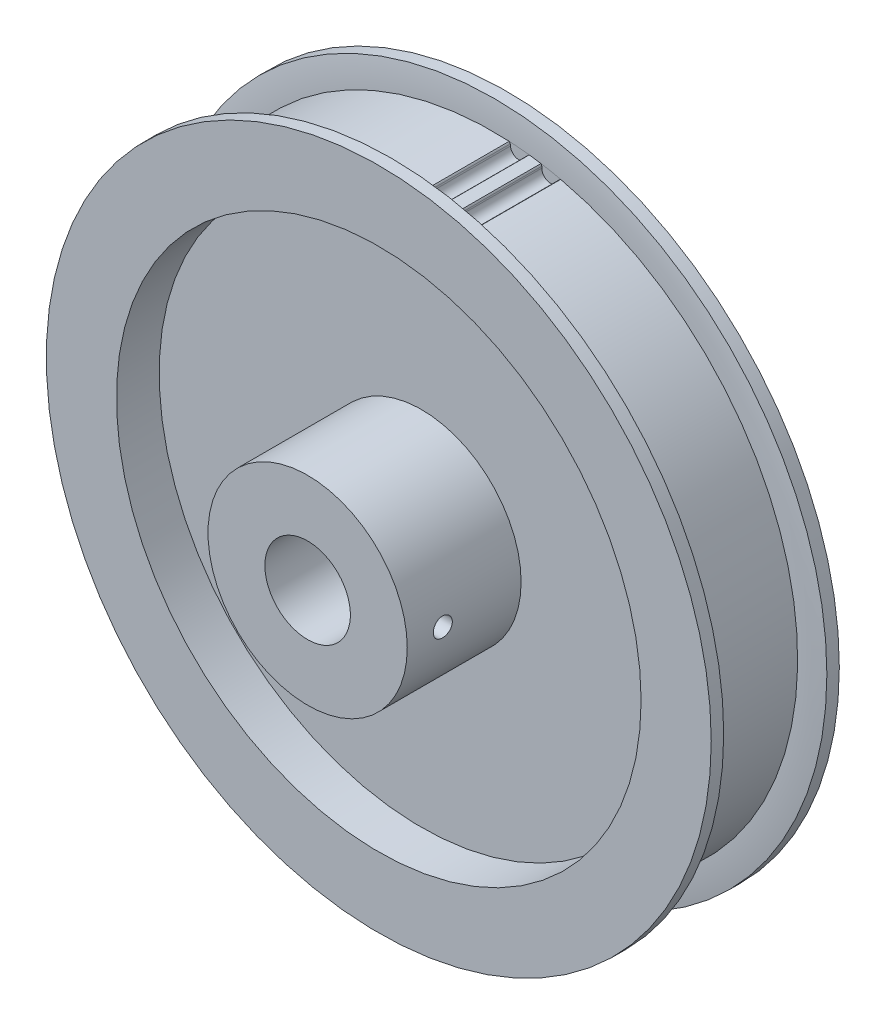
ISO-10303-21;
HEADER;
FILE_DESCRIPTION(('STEP AP214'),'2;1');
FILE_NAME('part.step','',(''),(''),'','','');
FILE_SCHEMA(('AUTOMOTIVE_DESIGN { 1 0 10303 214 1 1 1 1 }'));
ENDSEC;
DATA;
#1=APPLICATION_CONTEXT('core data for automotive mechanical design processes');
#2=APPLICATION_PROTOCOL_DEFINITION('international standard','automotive_design',2000,#1);
#3=PRODUCT_CONTEXT('',#1,'mechanical');
#4=PRODUCT('Part','Part','',(#3));
#5=PRODUCT_RELATED_PRODUCT_CATEGORY('part','',(#4));
#6=PRODUCT_DEFINITION_FORMATION('','',#4);
#7=PRODUCT_DEFINITION_CONTEXT('part definition',#1,'design');
#8=PRODUCT_DEFINITION('design','',#6,#7);
#9=PRODUCT_DEFINITION_SHAPE('','',#8);
#10=(LENGTH_UNIT() NAMED_UNIT(*) SI_UNIT(.MILLI.,.METRE.));
#11=(NAMED_UNIT(*) PLANE_ANGLE_UNIT() SI_UNIT($,.RADIAN.));
#12=(NAMED_UNIT(*) SI_UNIT($,.STERADIAN.) SOLID_ANGLE_UNIT());
#13=UNCERTAINTY_MEASURE_WITH_UNIT(LENGTH_MEASURE(1.E-05),#10,'distance_accuracy_value','');
#14=(GEOMETRIC_REPRESENTATION_CONTEXT(3) GLOBAL_UNCERTAINTY_ASSIGNED_CONTEXT((#13)) GLOBAL_UNIT_ASSIGNED_CONTEXT((#10,
#11,#12)) REPRESENTATION_CONTEXT('',''));
#15=CARTESIAN_POINT('',(0.,0.,0.));
#16=DIRECTION('',(0.,0.,1.));
#17=DIRECTION('',(1.,0.,0.));
#18=AXIS2_PLACEMENT_3D('',#15,#16,#17);
#19=CARTESIAN_POINT('',(0.,0.,15.08125));
#20=DIRECTION('',(0.,0.,-1.));
#21=DIRECTION('',(-1.,0.,0.));
#22=AXIS2_PLACEMENT_3D('',#19,#20,#21);
#23=CYLINDRICAL_SURFACE('',#22,4.76885);
#24=CARTESIAN_POINT('',(0.,0.,15.08125));
#25=DIRECTION('',(0.,0.,-1.));
#26=DIRECTION('',(-1.,0.,0.));
#27=AXIS2_PLACEMENT_3D('',#24,#25,#26);
#28=CIRCLE('',#27,4.76885);
#29=CARTESIAN_POINT('',(-4.76885,0.,15.08125));
#30=VERTEX_POINT('',#29);
#31=EDGE_CURVE('E20',#30,#30,#28,.T.);
#32=ORIENTED_EDGE('',*,*,#31,.F.);
#33=EDGE_LOOP('',(#32));
#34=FACE_BOUND('',#33,.T.);
#35=CARTESIAN_POINT('',(0.,0.,-7.14375));
#36=DIRECTION('',(0.,0.,-1.));
#37=DIRECTION('',(-1.,0.,0.));
#38=AXIS2_PLACEMENT_3D('',#35,#36,#37);
#39=CIRCLE('',#38,4.76885);
#40=CARTESIAN_POINT('',(-4.76885,0.,-7.14375));
#41=VERTEX_POINT('',#40);
#42=EDGE_CURVE('E616',#41,#41,#39,.T.);
#43=ORIENTED_EDGE('',*,*,#42,.T.);
#44=EDGE_LOOP('',(#43));
#45=FACE_BOUND('',#44,.T.);
#46=CARTESIAN_POINT('',(4.76885,0.,12.1708333333334));
#47=CARTESIAN_POINT('',(4.76884847306571,-0.0586123041048064,12.17083044195));
#48=CARTESIAN_POINT('',(4.76775734312836,-0.117295795218659,12.1659430419181));
#49=CARTESIAN_POINT('',(4.76350613938723,-0.2330437076321,12.1465291246467));
#50=CARTESIAN_POINT('',(4.7603420522376,-0.290104763764251,12.1319839086684));
#51=CARTESIAN_POINT('',(4.75229742473407,-0.400844929684411,12.0937325411842));
#52=CARTESIAN_POINT('',(4.74741952972268,-0.454529102128736,12.0700405026863));
#53=CARTESIAN_POINT('',(4.73647435346353,-0.5571418424057,12.0142065699433));
#54=CARTESIAN_POINT('',(4.7304074297014,-0.606071833002247,11.9820672144251));
#55=CARTESIAN_POINT('',(4.71763463518445,-0.698620847249218,11.9096827759978));
#56=CARTESIAN_POINT('',(4.7109205925116,-0.742149896327489,11.8693240760116));
#57=CARTESIAN_POINT('',(4.69766728828876,-0.82188187530551,11.781888529202));
#58=CARTESIAN_POINT('',(4.6911280522598,-0.858083740483086,11.734810707707));
#59=CARTESIAN_POINT('',(4.67888518332514,-0.922526682545571,11.6346126124925));
#60=CARTESIAN_POINT('',(4.67319191418832,-0.950672408242291,11.5814296333453));
#61=CARTESIAN_POINT('',(4.66340206452208,-0.997591991340194,11.4709418717254));
#62=CARTESIAN_POINT('',(4.65930527391939,-1.0163670818716,11.4136376327267));
#63=CARTESIAN_POINT('',(4.65325483593039,-1.04371677040196,11.2975035268964));
#64=CARTESIAN_POINT('',(4.65126796129376,-1.05244970180919,11.238712716185));
#65=CARTESIAN_POINT('',(4.64956255865491,-1.05995957296108,11.1204693760151));
#66=CARTESIAN_POINT('',(4.64984374652198,-1.05873775978254,11.0610169303745));
#67=CARTESIAN_POINT('',(4.65261263193993,-1.04650016245331,10.9443190716094));
#68=CARTESIAN_POINT('',(4.65505876969299,-1.03566883929887,10.8870531788706));
#69=CARTESIAN_POINT('',(4.66181620645629,-1.00481198001847,10.7751717294144));
#70=CARTESIAN_POINT('',(4.6661276262592,-0.984785848446423,10.7205563445944));
#71=CARTESIAN_POINT('',(4.67617067171151,-0.935938960169094,10.6150088795935));
#72=CARTESIAN_POINT('',(4.681913658347,-0.907047401484529,10.5641106924875));
#73=CARTESIAN_POINT('',(4.69416531023992,-0.841341705001432,10.4678204452049));
#74=CARTESIAN_POINT('',(4.70067402857244,-0.804527017880904,10.4224287671439));
#75=CARTESIAN_POINT('',(4.71390095516389,-0.723052709932271,10.3373819616924));
#76=CARTESIAN_POINT('',(4.72062061373945,-0.678237657979727,10.2978758300807));
#77=CARTESIAN_POINT('',(4.73338440331373,-0.582520218827615,10.2268984926627));
#78=CARTESIAN_POINT('',(4.73942824011096,-0.531615200324313,10.1954307785756));
#79=CARTESIAN_POINT('',(4.75018068491062,-0.424963998075343,10.1413864817509));
#80=CARTESIAN_POINT('',(4.75488521292261,-0.369203683150195,10.1188369874257));
#81=CARTESIAN_POINT('',(4.76239148758987,-0.254627675271092,10.0835132015441));
#82=CARTESIAN_POINT('',(4.76519721448175,-0.195818653498635,10.0707184550667));
#83=CARTESIAN_POINT('',(4.76754649622475,-0.113788746429426,10.0600534469669));
#84=CARTESIAN_POINT('',(4.76803417109396,-0.0910930120307624,10.0578478943051));
#85=CARTESIAN_POINT('',(4.7686862203424,-0.0456017778238444,10.0549039403021));
#86=CARTESIAN_POINT('',(4.76885059413613,-0.0228062778349896,10.0541655416179));
#87=CARTESIAN_POINT('',(4.76884847306572,0.0586123041048063,10.05416955805));
#88=CARTESIAN_POINT('',(4.76775734312836,0.117295795218659,10.0590569580819));
#89=CARTESIAN_POINT('',(4.76350613938723,0.233043707632099,10.0784708753533));
#90=CARTESIAN_POINT('',(4.7603420522376,0.290104763764251,10.0930160913316));
#91=CARTESIAN_POINT('',(4.75229742473407,0.400844929684412,10.1312674588158));
#92=CARTESIAN_POINT('',(4.74741952972267,0.454529102128737,10.1549594973137));
#93=CARTESIAN_POINT('',(4.73647435346353,0.557141842405701,10.2107934300567));
#94=CARTESIAN_POINT('',(4.7304074297014,0.606071833002247,10.2429327855749));
#95=CARTESIAN_POINT('',(4.71763463518445,0.698620847249218,10.3153172240022));
#96=CARTESIAN_POINT('',(4.7109205925116,0.742149896327489,10.3556759239884));
#97=CARTESIAN_POINT('',(4.69766728828876,0.82188187530551,10.443111470798));
#98=CARTESIAN_POINT('',(4.6911280522598,0.858083740483086,10.490189292293));
#99=CARTESIAN_POINT('',(4.67888518332514,0.922526682545571,10.5903873875075));
#100=CARTESIAN_POINT('',(4.67319191418832,0.95067240824229,10.6435703666547));
#101=CARTESIAN_POINT('',(4.66340206452208,0.997591991340194,10.7540581282746));
#102=CARTESIAN_POINT('',(4.65930527391939,1.0163670818716,10.8113623672733));
#103=CARTESIAN_POINT('',(4.65325483593039,1.04371677040196,10.9274964731036));
#104=CARTESIAN_POINT('',(4.65126796129376,1.05244970180919,10.986287283815));
#105=CARTESIAN_POINT('',(4.64956255865491,1.05995957296108,11.1045306239849));
#106=CARTESIAN_POINT('',(4.64984374652198,1.05873775978254,11.1639830696255));
#107=CARTESIAN_POINT('',(4.65261263193993,1.04650016245331,11.2806809283906));
#108=CARTESIAN_POINT('',(4.65505876969299,1.03566883929887,11.3379468211294));
#109=CARTESIAN_POINT('',(4.66181620645629,1.00481198001847,11.4498282705856));
#110=CARTESIAN_POINT('',(4.6661276262592,0.984785848446423,11.5044436554056));
#111=CARTESIAN_POINT('',(4.67617067171151,0.935938960169094,11.6099911204065));
#112=CARTESIAN_POINT('',(4.681913658347,0.907047401484529,11.6608893075125));
#113=CARTESIAN_POINT('',(4.69416531023991,0.841341705001432,11.7571795547951));
#114=CARTESIAN_POINT('',(4.70067402857244,0.804527017880904,11.8025712328561));
#115=CARTESIAN_POINT('',(4.71390095516389,0.723052709932272,11.8876180383076));
#116=CARTESIAN_POINT('',(4.72062061373945,0.678237657979727,11.9271241699193));
#117=CARTESIAN_POINT('',(4.73338440331373,0.582520218827616,11.9981015073373));
#118=CARTESIAN_POINT('',(4.73942824011096,0.531615200324313,12.0295692214244));
#119=CARTESIAN_POINT('',(4.75018068491062,0.424963998075343,12.0836135182491));
#120=CARTESIAN_POINT('',(4.75488521292261,0.369203683150194,12.1061630125743));
#121=CARTESIAN_POINT('',(4.76239148758987,0.254627675271092,12.1414867984559));
#122=CARTESIAN_POINT('',(4.76519721448175,0.195818653498635,12.1542815449333));
#123=CARTESIAN_POINT('',(4.76754649622475,0.113788746429426,12.1649465530331));
#124=CARTESIAN_POINT('',(4.76803417109396,0.0910930120307626,12.1671521056949));
#125=CARTESIAN_POINT('',(4.7686862203424,0.0456017778238447,12.1700960596979));
#126=CARTESIAN_POINT('',(4.76885059413613,0.0228062778349899,12.1708344583821));
#127=CARTESIAN_POINT('',(4.76885,0.,12.1708333333334));
#128=B_SPLINE_CURVE_WITH_KNOTS('',3,(#46,#47,#48,#49,#50,#51,#52,#53,#54,#55,#56,#57,#58,#59,
#60,#61,#62,#63,#64,#65,#66,#67,#68,#69,#70,#71,#72,#73,#74,#75,#76,#77,#78,#79,#80,#81,#82,#83,
#84,#85,#86,#87,#88,#89,#90,#91,#92,#93,#94,#95,#96,#97,#98,#99,#100,#101,#102,#103,#104,#105,
#106,#107,#108,#109,#110,#111,#112,#113,#114,#115,#116,#117,#118,#119,#120,#121,#122,#123,#124,
#125,#126,#127),.UNSPECIFIED.,.T.,.F.,(4,2,2,2,2,2,2,2,2,2,2,2,2,2,2,2,2,2,2,2,2,2,2,2,2,2,2,2,
2,2,2,2,2,2,2,2,2,2,2,2,4),(0.,0.175749615830444,0.351840500975271,0.527660767156468,
0.703428253231945,0.881814109226019,1.06022586810902,1.24066935647048,1.42108909307747,
1.59862339281777,1.77613545235915,1.95031204400599,2.12449991673606,2.30011680096918,
2.47574586490048,2.65525742576131,2.83484683057527,3.0149776104805,3.19472962378812,
3.26311436604358,3.33149923214361,3.50724884797406,3.68333973311889,3.85915999930008,
4.03492748537556,4.21331334136963,4.39172510025263,4.57216858861409,4.75258832522109,
4.93012262496138,5.10763468450276,5.2818112761496,5.45599914887968,5.6316160331128,
5.80724509704409,5.98675665790492,6.16634606271888,6.34647684262411,6.52622885593174,
6.59461359818719,6.66299846428723),.UNSPECIFIED.);
#129=CARTESIAN_POINT('',(4.76885,0.,12.1708333333334));
#130=VERTEX_POINT('',#129);
#131=EDGE_CURVE('E619',#130,#130,#128,.T.);
#132=ORIENTED_EDGE('',*,*,#131,.T.);
#133=EDGE_LOOP('',(#132));
#134=FACE_BOUND('',#133,.T.);
#135=ADVANCED_FACE('F16',(#34,#45,#134),#23,.F.);
#136=CARTESIAN_POINT('',(0.,0.,15.08125));
#137=DIRECTION('',(0.,0.,1.));
#138=DIRECTION('',(1.,0.,0.));
#139=AXIS2_PLACEMENT_3D('',#136,#137,#138);
#140=PLANE('',#139);
#141=ORIENTED_EDGE('',*,*,#31,.T.);
#142=EDGE_LOOP('',(#141));
#143=FACE_BOUND('',#142,.T.);
#144=CARTESIAN_POINT('',(0.,0.,15.08125));
#145=DIRECTION('',(0.,0.,1.));
#146=DIRECTION('',(1.,0.,0.));
#147=AXIS2_PLACEMENT_3D('',#144,#145,#146);
#148=CIRCLE('',#147,11.1125);
#149=CARTESIAN_POINT('',(11.1125,0.,15.08125));
#150=VERTEX_POINT('',#149);
#151=EDGE_CURVE('E250',#150,#150,#148,.F.);
#152=ORIENTED_EDGE('',*,*,#151,.F.);
#153=EDGE_LOOP('',(#152));
#154=FACE_BOUND('',#153,.T.);
#155=ADVANCED_FACE('F269',(#143,#154),#140,.T.);
#156=CARTESIAN_POINT('',(0.,0.,11.1125));
#157=DIRECTION('',(-1.,0.,0.));
#158=DIRECTION('',(0.,0.,1.));
#159=AXIS2_PLACEMENT_3D('',#156,#157,#158);
#160=CYLINDRICAL_SURFACE('',#159,1.05833333333342);
#161=ORIENTED_EDGE('',*,*,#131,.F.);
#162=EDGE_LOOP('',(#161));
#163=FACE_BOUND('',#162,.T.);
#164=CARTESIAN_POINT('',(11.1125,0.,10.0541666666666));
#165=CARTESIAN_POINT('',(11.1124989638523,-0.0592671550999744,10.0541714540668));
#166=CARTESIAN_POINT('',(11.1120206208282,-0.118584544200863,10.0591635092179));
#167=CARTESIAN_POINT('',(11.1101565200235,-0.235630334602228,10.0790184258732));
#168=CARTESIAN_POINT('',(11.1087688521852,-0.293355124043965,10.093902065816));
#169=CARTESIAN_POINT('',(11.1052431819375,-0.405425493440314,10.1331030809392));
#170=CARTESIAN_POINT('',(11.1031059087191,-0.459774297178893,10.1574112906278));
#171=CARTESIAN_POINT('',(11.0983206357579,-0.563594837914847,10.2147548282555));
#172=CARTESIAN_POINT('',(11.0956728607508,-0.613068706553428,10.2477863183431));
#173=CARTESIAN_POINT('',(11.0901530073947,-0.705929242623906,10.3217614117352));
#174=CARTESIAN_POINT('',(11.0872802783227,-0.749297152851714,10.3627285149114));
#175=CARTESIAN_POINT('',(11.0816395852796,-0.828554895579713,10.4513637308074));
#176=CARTESIAN_POINT('',(11.0788716311944,-0.864444023858242,10.499032473864));
#177=CARTESIAN_POINT('',(11.0737475705315,-0.927785738639724,10.5998279840321));
#178=CARTESIAN_POINT('',(11.0713922559129,-0.955222177184333,10.6529649425153));
#179=CARTESIAN_POINT('',(11.0673677624902,-1.00077625106514,10.7631173073537));
#180=CARTESIAN_POINT('',(11.0656985622257,-1.01889417787304,10.8201325923364));
#181=CARTESIAN_POINT('',(11.0632408497598,-1.04524377560842,10.9362392823233));
#182=CARTESIAN_POINT('',(11.0624496683685,-1.05350541556563,10.995323828622));
#183=CARTESIAN_POINT('',(11.0618292482857,-1.06000054026498,11.1140459311561));
#184=CARTESIAN_POINT('',(11.0619999882178,-1.05823424785272,11.1736834750731));
#185=CARTESIAN_POINT('',(11.0632816825826,-1.04474839497381,11.2916117994292));
#186=CARTESIAN_POINT('',(11.0643895416912,-1.03306160168072,11.3499063653701));
#187=CARTESIAN_POINT('',(11.0674158220506,-1.00011727524658,11.4637033798779));
#188=CARTESIAN_POINT('',(11.0693342607473,-0.978859536112667,11.5192057683209));
#189=CARTESIAN_POINT('',(11.0737691809829,-0.927339550973742,11.6259479297947));
#190=CARTESIAN_POINT('',(11.0762866503851,-0.89706241004613,11.6771804709455));
#191=CARTESIAN_POINT('',(11.0816348512314,-0.828376587534368,11.7738448319784));
#192=CARTESIAN_POINT('',(11.0844655650076,-0.789968364457045,11.8192769787097));
#193=CARTESIAN_POINT('',(11.0901347397117,-0.705934814809366,11.903238132352));
#194=CARTESIAN_POINT('',(11.0929731891309,-0.660282581488272,11.9417402132193));
#195=CARTESIAN_POINT('',(11.0983291739985,-0.563124310775004,12.0105563316129));
#196=CARTESIAN_POINT('',(11.100846560153,-0.511615571019497,12.04086656722));
#197=CARTESIAN_POINT('',(11.1052778699882,-0.404169772358272,12.0924350310275));
#198=CARTESIAN_POINT('',(11.1071912033874,-0.348228448275424,12.113684412009));
#199=CARTESIAN_POINT('',(11.1101905600753,-0.233641506069249,12.1464335634387));
#200=CARTESIAN_POINT('',(11.1112783381809,-0.175001906658918,12.1579540197964));
#201=CARTESIAN_POINT('',(11.1122977915828,-0.0773879058659506,12.168712617274));
#202=CARTESIAN_POINT('',(11.1125006766606,-0.0387046648261569,12.1708364597652));
#203=CARTESIAN_POINT('',(11.1124989638523,0.0592671550999725,12.1708285459332));
#204=CARTESIAN_POINT('',(11.1120206208282,0.118584544200862,12.1658364907821));
#205=CARTESIAN_POINT('',(11.1101565200235,0.235630334602226,12.1459815741268));
#206=CARTESIAN_POINT('',(11.1087688521852,0.293355124043963,12.131097934184));
#207=CARTESIAN_POINT('',(11.1052431819375,0.405425493440313,12.0918969190608));
#208=CARTESIAN_POINT('',(11.1031059087191,0.459774297178892,12.0675887093722));
#209=CARTESIAN_POINT('',(11.0983206357579,0.563594837914846,12.0102451717445));
#210=CARTESIAN_POINT('',(11.0956728607508,0.613068706553428,11.9772136816569));
#211=CARTESIAN_POINT('',(11.0901530073947,0.705929242623905,11.9032385882648));
#212=CARTESIAN_POINT('',(11.0872802783227,0.749297152851714,11.8622714850886));
#213=CARTESIAN_POINT('',(11.0816395852796,0.828554895579712,11.7736362691926));
#214=CARTESIAN_POINT('',(11.0788716311944,0.864444023858242,11.725967526136));
#215=CARTESIAN_POINT('',(11.0737475705315,0.927785738639723,11.6251720159679));
#216=CARTESIAN_POINT('',(11.0713922559129,0.955222177184332,11.5720350574847));
#217=CARTESIAN_POINT('',(11.0673677624902,1.00077625106514,11.4618826926463));
#218=CARTESIAN_POINT('',(11.0656985622257,1.01889417787304,11.4048674076636));
#219=CARTESIAN_POINT('',(11.0632408497598,1.04524377560842,11.2887607176767));
#220=CARTESIAN_POINT('',(11.0624496683685,1.05350541556563,11.229676171378));
#221=CARTESIAN_POINT('',(11.0618292482857,1.06000054026498,11.1109540688439));
#222=CARTESIAN_POINT('',(11.0619999882178,1.05823424785272,11.0513165249269));
#223=CARTESIAN_POINT('',(11.0632816825826,1.04474839497381,10.9333882005708));
#224=CARTESIAN_POINT('',(11.0643895416912,1.03306160168072,10.8750936346299));
#225=CARTESIAN_POINT('',(11.0674158220506,1.00011727524658,10.7612966201221));
#226=CARTESIAN_POINT('',(11.0693342607473,0.978859536112667,10.7057942316791));
#227=CARTESIAN_POINT('',(11.0737691809829,0.927339550973742,10.5990520702053));
#228=CARTESIAN_POINT('',(11.0762866503851,0.897062410046131,10.5478195290545));
#229=CARTESIAN_POINT('',(11.0816348512314,0.828376587534369,10.4511551680216));
#230=CARTESIAN_POINT('',(11.0844655650076,0.789968364457046,10.4057230212903));
#231=CARTESIAN_POINT('',(11.0901347397117,0.705934814809367,10.321761867648));
#232=CARTESIAN_POINT('',(11.0929731891309,0.660282581488274,10.2832597867807));
#233=CARTESIAN_POINT('',(11.0983291739985,0.563124310775006,10.2144436683871));
#234=CARTESIAN_POINT('',(11.100846560153,0.511615571019499,10.18413343278));
#235=CARTESIAN_POINT('',(11.1052778699882,0.404169772358273,10.1325649689725));
#236=CARTESIAN_POINT('',(11.1071912033874,0.348228448275425,10.111315587991));
#237=CARTESIAN_POINT('',(11.1101905600753,0.23364150606925,10.0785664365613));
#238=CARTESIAN_POINT('',(11.1112783381809,0.17500190665892,10.0670459802036));
#239=CARTESIAN_POINT('',(11.1122977915828,0.0773879058659508,10.056287382726));
#240=CARTESIAN_POINT('',(11.1125006766606,0.0387046648261561,10.0541635402348));
#241=CARTESIAN_POINT('',(11.1125,0.,10.0541666666666));
#242=B_SPLINE_CURVE_WITH_KNOTS('',3,(#164,#165,#166,#167,#168,#169,#170,#171,#172,#173,#174,
#175,#176,#177,#178,#179,#180,#181,#182,#183,#184,#185,#186,#187,#188,#189,#190,#191,#192,#193,
#194,#195,#196,#197,#198,#199,#200,#201,#202,#203,#204,#205,#206,#207,#208,#209,#210,#211,#212,
#213,#214,#215,#216,#217,#218,#219,#220,#221,#222,#223,#224,#225,#226,#227,#228,#229,#230,#231,
#232,#233,#234,#235,#236,#237,#238,#239,#240,#241),.UNSPECIFIED.,.T.,.F.,(4,2,2,2,2,2,2,2,2,2,2,
2,2,2,2,2,2,2,2,2,2,2,2,2,2,2,2,2,2,2,2,2,2,2,2,2,2,2,4),(0.,0.17767848080587,0.355731380887713,
0.533611555268287,0.711413600359596,0.889750453398903,1.06810409152203,1.24679637206856,
1.42548306299802,1.60362504299602,1.7817630642513,1.9593149791827,2.13687071569815,
2.31472131436022,2.49256188680419,2.67107918749631,2.84967919817254,3.02845320072284,
3.20684612507444,3.32287980401198,3.50055828481785,3.67861118489969,3.85649135928027,
4.03429340437158,4.21263025741088,4.390983895534,4.56967617608054,4.74836286701,4.926504847008,
5.10464286826328,5.28219478319468,5.45975051971012,5.6376011183722,5.81544169081616,
5.99395899150829,6.17255900218452,6.35133300473481,6.52972592908641,6.64575960802396),.UNSPECIFIED.);
#243=CARTESIAN_POINT('',(11.1125,0.,10.0541666666666));
#244=VERTEX_POINT('',#243);
#245=EDGE_CURVE('E243',#244,#244,#242,.T.);
#246=ORIENTED_EDGE('',*,*,#245,.F.);
#247=EDGE_LOOP('',(#246));
#248=FACE_BOUND('',#247,.T.);
#249=ADVANCED_FACE('F252',(#163,#248),#160,.F.);
#250=CARTESIAN_POINT('',(0.,0.,-7.14375));
#251=DIRECTION('',(0.,0.,1.));
#252=DIRECTION('',(1.,0.,0.));
#253=AXIS2_PLACEMENT_3D('',#250,#251,#252);
#254=PLANE('',#253);
#255=ORIENTED_EDGE('',*,*,#42,.F.);
#256=EDGE_LOOP('',(#255));
#257=FACE_BOUND('',#256,.T.);
#258=CARTESIAN_POINT('',(0.,0.,-7.14375));
#259=DIRECTION('',(0.,0.,1.));
#260=DIRECTION('',(1.,0.,0.));
#261=AXIS2_PLACEMENT_3D('',#258,#259,#260);
#262=CIRCLE('',#261,11.1125);
#263=CARTESIAN_POINT('',(11.1125,0.,-7.14375));
#264=VERTEX_POINT('',#263);
#265=EDGE_CURVE('E150',#264,#264,#262,.T.);
#266=ORIENTED_EDGE('',*,*,#265,.F.);
#267=EDGE_LOOP('',(#266));
#268=FACE_BOUND('',#267,.T.);
#269=ADVANCED_FACE('F260',(#257,#268),#254,.F.);
#270=CARTESIAN_POINT('',(0.,0.,7.14375));
#271=DIRECTION('',(0.,0.,1.));
#272=DIRECTION('',(1.,0.,0.));
#273=AXIS2_PLACEMENT_3D('',#270,#271,#272);
#274=CYLINDRICAL_SURFACE('',#273,11.1125);
#275=ORIENTED_EDGE('',*,*,#151,.T.);
#276=EDGE_LOOP('',(#275));
#277=FACE_BOUND('',#276,.T.);
#278=CARTESIAN_POINT('',(0.,0.,2.38125));
#279=DIRECTION('',(0.,0.,1.));
#280=DIRECTION('',(1.,0.,0.));
#281=AXIS2_PLACEMENT_3D('',#278,#279,#280);
#282=CIRCLE('',#281,11.1125);
#283=CARTESIAN_POINT('',(11.1125,0.,2.38125));
#284=VERTEX_POINT('',#283);
#285=EDGE_CURVE('E155',#284,#284,#282,.F.);
#286=ORIENTED_EDGE('',*,*,#285,.F.);
#287=EDGE_LOOP('',(#286));
#288=FACE_BOUND('',#287,.T.);
#289=ORIENTED_EDGE('',*,*,#245,.T.);
#290=EDGE_LOOP('',(#289));
#291=FACE_BOUND('',#290,.T.);
#292=ADVANCED_FACE('F255',(#277,#288,#291),#274,.T.);
#293=CARTESIAN_POINT('',(0.,0.,-7.14375));
#294=DIRECTION('',(0.,0.,1.));
#295=DIRECTION('',(1.,0.,0.));
#296=AXIS2_PLACEMENT_3D('',#293,#294,#295);
#297=CYLINDRICAL_SURFACE('',#296,11.1125);
#298=CARTESIAN_POINT('',(0.,0.,-2.38125));
#299=DIRECTION('',(0.,0.,1.));
#300=DIRECTION('',(1.,0.,0.));
#301=AXIS2_PLACEMENT_3D('',#298,#299,#300);
#302=CIRCLE('',#301,11.1125);
#303=CARTESIAN_POINT('',(11.1125,0.,-2.38125));
#304=VERTEX_POINT('',#303);
#305=EDGE_CURVE('E117',#304,#304,#302,.F.);
#306=ORIENTED_EDGE('',*,*,#305,.T.);
#307=EDGE_LOOP('',(#306));
#308=FACE_BOUND('',#307,.T.);
#309=ORIENTED_EDGE('',*,*,#265,.T.);
#310=EDGE_LOOP('',(#309));
#311=FACE_BOUND('',#310,.T.);
#312=ADVANCED_FACE('F259',(#308,#311),#297,.T.);
#313=CARTESIAN_POINT('',(0.,0.,-5.55625));
#314=DIRECTION('',(0.,0.,1.));
#315=DIRECTION('',(1.,0.,0.));
#316=AXIS2_PLACEMENT_3D('',#313,#314,#315);
#317=CYLINDRICAL_SURFACE('',#316,34.0233);
#318=CARTESIAN_POINT('',(0.,0.,5.55625));
#319=DIRECTION('',(0.,0.,1.));
#320=DIRECTION('',(1.,0.,0.));
#321=AXIS2_PLACEMENT_3D('',#318,#319,#320);
#322=CIRCLE('',#321,34.0233);
#323=CARTESIAN_POINT('',(4.08008015799396,33.7777721111746,5.55625));
#324=VERTEX_POINT('',#323);
#325=CARTESIAN_POINT('',(5.38839101787508,33.5939010108708,5.55625));
#326=VERTEX_POINT('',#325);
#327=EDGE_CURVE('E149',#324,#326,#322,.F.);
#328=ORIENTED_EDGE('',*,*,#327,.T.);
#329=DIRECTION('',(0.,0.,1.));
#330=VECTOR('',#329,1.);
#331=CARTESIAN_POINT('',(5.38839101787458,33.5939010108693,5.55625));
#332=LINE('',#331,#330);
#333=CARTESIAN_POINT('',(5.38839101787503,33.5939010108705,-5.55625));
#334=VERTEX_POINT('',#333);
#335=EDGE_CURVE('E140',#334,#326,#332,.T.);
#336=ORIENTED_EDGE('',*,*,#335,.F.);
#337=CARTESIAN_POINT('',(0.,0.,-5.55625));
#338=DIRECTION('',(0.,0.,1.));
#339=DIRECTION('',(1.,0.,0.));
#340=AXIS2_PLACEMENT_3D('',#337,#338,#339);
#341=CIRCLE('',#340,34.0233);
#342=CARTESIAN_POINT('',(4.08008015799395,33.7777721111746,-5.55625));
#343=VERTEX_POINT('',#342);
#344=EDGE_CURVE('E146',#334,#343,#341,.T.);
#345=ORIENTED_EDGE('',*,*,#344,.T.);
#346=DIRECTION('',(0.,0.,1.));
#347=VECTOR('',#346,1.);
#348=CARTESIAN_POINT('',(4.08008015799279,33.7777721111769,5.55625));
#349=LINE('',#348,#347);
#350=EDGE_CURVE('E114',#324,#343,#349,.F.);
#351=ORIENTED_EDGE('',*,*,#350,.F.);
#352=EDGE_LOOP('',(#328,#336,#345,#351));
#353=FACE_BOUND('',#352,.T.);
#354=ADVANCED_FACE('F441',(#353),#317,.T.);
#355=CARTESIAN_POINT('',(0.,0.,2.38125));
#356=DIRECTION('',(0.,0.,1.));
#357=DIRECTION('',(1.,0.,0.));
#358=AXIS2_PLACEMENT_3D('',#355,#356,#357);
#359=PLANE('',#358);
#360=ORIENTED_EDGE('',*,*,#285,.T.);
#361=EDGE_LOOP('',(#360));
#362=FACE_BOUND('',#361,.T.);
#363=CARTESIAN_POINT('',(0.,0.,2.38125));
#364=DIRECTION('',(0.,0.,1.));
#365=DIRECTION('',(1.,0.,0.));
#366=AXIS2_PLACEMENT_3D('',#363,#364,#365);
#367=CIRCLE('',#366,29.2608);
#368=CARTESIAN_POINT('',(29.2608,0.,2.38125));
#369=VERTEX_POINT('',#368);
#370=EDGE_CURVE('E134',#369,#369,#367,.T.);
#371=ORIENTED_EDGE('',*,*,#370,.T.);
#372=EDGE_LOOP('',(#371));
#373=FACE_BOUND('',#372,.T.);
#374=ADVANCED_FACE('F438',(#362,#373),#359,.T.);
#375=CARTESIAN_POINT('',(0.,0.,-2.38125));
#376=DIRECTION('',(0.,0.,1.));
#377=DIRECTION('',(1.,0.,0.));
#378=AXIS2_PLACEMENT_3D('',#375,#376,#377);
#379=PLANE('',#378);
#380=ORIENTED_EDGE('',*,*,#305,.F.);
#381=EDGE_LOOP('',(#380));
#382=FACE_BOUND('',#381,.T.);
#383=CARTESIAN_POINT('',(0.,0.,-2.38125));
#384=DIRECTION('',(0.,0.,1.));
#385=DIRECTION('',(1.,0.,0.));
#386=AXIS2_PLACEMENT_3D('',#383,#384,#385);
#387=CIRCLE('',#386,29.2608);
#388=CARTESIAN_POINT('',(29.2608,0.,-2.38125));
#389=VERTEX_POINT('',#388);
#390=EDGE_CURVE('E131',#389,#389,#387,.F.);
#391=ORIENTED_EDGE('',*,*,#390,.T.);
#392=EDGE_LOOP('',(#391));
#393=FACE_BOUND('',#392,.T.);
#394=ADVANCED_FACE('F435',(#382,#393),#379,.F.);
#395=CARTESIAN_POINT('',(4.2201125656381,33.5127758787338,5.55625));
#396=DIRECTION('',(0.,0.,1.));
#397=DIRECTION('',(1.,0.,0.));
#398=AXIS2_PLACEMENT_3D('',#395,#396,#397);
#399=CYLINDRICAL_SURFACE('',#398,0.29972);
#400=CARTESIAN_POINT('',(4.2201125656381,33.5127758787338,5.55625));
#401=DIRECTION('',(0.,0.,1.));
#402=DIRECTION('',(1.,0.,0.));
#403=AXIS2_PLACEMENT_3D('',#400,#401,#402);
#404=CIRCLE('',#403,0.29972);
#405=CARTESIAN_POINT('',(3.93338391434515,33.6000613811274,5.55625));
#406=VERTEX_POINT('',#405);
#407=EDGE_CURVE('E102',#406,#324,#404,.F.);
#408=ORIENTED_EDGE('',*,*,#407,.T.);
#409=ORIENTED_EDGE('',*,*,#350,.T.);
#410=CARTESIAN_POINT('',(4.2201125656381,33.5127758787338,-5.55625));
#411=DIRECTION('',(0.,0.,1.));
#412=DIRECTION('',(1.,0.,0.));
#413=AXIS2_PLACEMENT_3D('',#410,#411,#412);
#414=CIRCLE('',#413,0.29972);
#415=CARTESIAN_POINT('',(3.93338391434515,33.6000613811274,-5.55625));
#416=VERTEX_POINT('',#415);
#417=EDGE_CURVE('E107',#343,#416,#414,.T.);
#418=ORIENTED_EDGE('',*,*,#417,.T.);
#419=DIRECTION('',(0.,0.,1.));
#420=VECTOR('',#419,1.);
#421=CARTESIAN_POINT('',(3.9333839143439,33.6000613811255,5.55625));
#422=LINE('',#421,#420);
#423=EDGE_CURVE('E111',#406,#416,#422,.F.);
#424=ORIENTED_EDGE('',*,*,#423,.F.);
#425=EDGE_LOOP('',(#408,#409,#418,#424));
#426=FACE_BOUND('',#425,.T.);
#427=ADVANCED_FACE('F109',(#426),#399,.T.);
#428=CARTESIAN_POINT('',(5.1807403674038,33.377768445625,5.55625));
#429=DIRECTION('',(0.,0.,1.));
#430=DIRECTION('',(1.,0.,0.));
#431=AXIS2_PLACEMENT_3D('',#428,#429,#430);
#432=CYLINDRICAL_SURFACE('',#431,0.29972);
#433=CARTESIAN_POINT('',(5.1807403674038,33.377768445625,-5.55625));
#434=DIRECTION('',(0.,0.,1.));
#435=DIRECTION('',(1.,0.,0.));
#436=AXIS2_PLACEMENT_3D('',#433,#434,#435);
#437=CIRCLE('',#436,0.29972);
#438=CARTESIAN_POINT('',(5.48042078209965,33.3826395284124,-5.55625));
#439=VERTEX_POINT('',#438);
#440=EDGE_CURVE('E143',#439,#334,#437,.T.);
#441=ORIENTED_EDGE('',*,*,#440,.T.);
#442=ORIENTED_EDGE('',*,*,#335,.T.);
#443=CARTESIAN_POINT('',(5.1807403674038,33.377768445625,5.55625));
#444=DIRECTION('',(0.,0.,1.));
#445=DIRECTION('',(1.,0.,0.));
#446=AXIS2_PLACEMENT_3D('',#443,#444,#445);
#447=CIRCLE('',#446,0.29972);
#448=CARTESIAN_POINT('',(5.48042078209965,33.3826395284124,5.55625));
#449=VERTEX_POINT('',#448);
#450=EDGE_CURVE('E159',#326,#449,#447,.F.);
#451=ORIENTED_EDGE('',*,*,#450,.T.);
#452=DIRECTION('',(0.,0.,1.));
#453=VECTOR('',#452,1.);
#454=CARTESIAN_POINT('',(5.48042078209927,33.3826395284152,5.55625));
#455=LINE('',#454,#453);
#456=EDGE_CURVE('E138',#439,#449,#455,.T.);
#457=ORIENTED_EDGE('',*,*,#456,.F.);
#458=EDGE_LOOP('',(#441,#442,#451,#457));
#459=FACE_BOUND('',#458,.T.);
#460=ADVANCED_FACE('F428',(#459),#432,.T.);
#461=CARTESIAN_POINT('',(0.,0.,7.14375));
#462=DIRECTION('',(0.,0.,1.));
#463=DIRECTION('',(1.,0.,0.));
#464=AXIS2_PLACEMENT_3D('',#461,#462,#463);
#465=CYLINDRICAL_SURFACE('',#464,29.2608);
#466=ORIENTED_EDGE('',*,*,#370,.F.);
#467=EDGE_LOOP('',(#466));
#468=FACE_BOUND('',#467,.T.);
#469=CARTESIAN_POINT('',(0.,0.,7.14375));
#470=DIRECTION('',(0.,0.,1.));
#471=DIRECTION('',(1.,0.,0.));
#472=AXIS2_PLACEMENT_3D('',#469,#470,#471);
#473=CIRCLE('',#472,29.2608);
#474=CARTESIAN_POINT('',(29.2608,0.,7.14375));
#475=VERTEX_POINT('',#474);
#476=EDGE_CURVE('E214',#475,#475,#473,.F.);
#477=ORIENTED_EDGE('',*,*,#476,.F.);
#478=EDGE_LOOP('',(#477));
#479=FACE_BOUND('',#478,.T.);
#480=ADVANCED_FACE('F424',(#468,#479),#465,.F.);
#481=CARTESIAN_POINT('',(0.,0.,-7.14375));
#482=DIRECTION('',(0.,0.,1.));
#483=DIRECTION('',(1.,0.,0.));
#484=AXIS2_PLACEMENT_3D('',#481,#482,#483);
#485=CYLINDRICAL_SURFACE('',#484,29.2608);
#486=ORIENTED_EDGE('',*,*,#390,.F.);
#487=EDGE_LOOP('',(#486));
#488=FACE_BOUND('',#487,.T.);
#489=CARTESIAN_POINT('',(0.,0.,-7.14375));
#490=DIRECTION('',(0.,0.,1.));
#491=DIRECTION('',(1.,0.,0.));
#492=AXIS2_PLACEMENT_3D('',#489,#490,#491);
#493=CIRCLE('',#492,29.2608);
#494=CARTESIAN_POINT('',(29.2608,0.,-7.14375));
#495=VERTEX_POINT('',#494);
#496=EDGE_CURVE('E210',#495,#495,#493,.F.);
#497=ORIENTED_EDGE('',*,*,#496,.T.);
#498=EDGE_LOOP('',(#497));
#499=FACE_BOUND('',#498,.T.);
#500=ADVANCED_FACE('F421',(#488,#499),#485,.F.);
#501=CARTESIAN_POINT('',(14.8679511246225,30.2713769677422,5.55625));
#502=DIRECTION('',(0.,0.,1.));
#503=DIRECTION('',(1.,0.,0.));
#504=AXIS2_PLACEMENT_3D('',#501,#502,#503);
#505=CYLINDRICAL_SURFACE('',#504,11.43);
#506=DIRECTION('',(0.,0.,1.));
#507=VECTOR('',#506,1.);
#508=CARTESIAN_POINT('',(3.87993376857243,33.4191340395511,5.55625));
#509=LINE('',#508,#507);
#510=CARTESIAN_POINT('',(3.87993376857318,33.4191340395553,-5.55625));
#511=VERTEX_POINT('',#510);
#512=CARTESIAN_POINT('',(3.87993376857318,33.4191340395553,5.55625));
#513=VERTEX_POINT('',#512);
#514=EDGE_CURVE('E213',#511,#513,#509,.T.);
#515=ORIENTED_EDGE('',*,*,#514,.T.);
#516=CARTESIAN_POINT('',(14.8679511246225,30.2713769677422,5.55625));
#517=DIRECTION('',(0.,0.,1.));
#518=DIRECTION('',(1.,0.,0.));
#519=AXIS2_PLACEMENT_3D('',#516,#517,#518);
#520=CIRCLE('',#519,11.43);
#521=EDGE_CURVE('E128',#513,#406,#520,.F.);
#522=ORIENTED_EDGE('',*,*,#521,.T.);
#523=ORIENTED_EDGE('',*,*,#423,.T.);
#524=CARTESIAN_POINT('',(14.8679511246225,30.2713769677422,-5.55625));
#525=DIRECTION('',(0.,0.,1.));
#526=DIRECTION('',(1.,0.,0.));
#527=AXIS2_PLACEMENT_3D('',#524,#525,#526);
#528=CIRCLE('',#527,11.43);
#529=EDGE_CURVE('E120',#416,#511,#528,.T.);
#530=ORIENTED_EDGE('',*,*,#529,.T.);
#531=EDGE_LOOP('',(#515,#522,#523,#530));
#532=FACE_BOUND('',#531,.T.);
#533=ADVANCED_FACE('F130',(#532),#505,.T.);
#534=CARTESIAN_POINT('',(-5.94806960885858,33.1968778967896,5.55625));
#535=DIRECTION('',(0.,0.,1.));
#536=DIRECTION('',(1.,0.,0.));
#537=AXIS2_PLACEMENT_3D('',#534,#535,#536);
#538=CYLINDRICAL_SURFACE('',#537,11.43);
#539=ORIENTED_EDGE('',*,*,#456,.T.);
#540=CARTESIAN_POINT('',(-5.94806960885858,33.1968778967896,5.55625));
#541=DIRECTION('',(0.,0.,1.));
#542=DIRECTION('',(1.,0.,0.));
#543=AXIS2_PLACEMENT_3D('',#540,#541,#542);
#544=CIRCLE('',#543,11.43);
#545=CARTESIAN_POINT('',(5.48193002584687,33.1939881483641,5.55625));
#546=VERTEX_POINT('',#545);
#547=EDGE_CURVE('E217',#449,#546,#544,.F.);
#548=ORIENTED_EDGE('',*,*,#547,.T.);
#549=DIRECTION('',(0.,0.,1.));
#550=VECTOR('',#549,1.);
#551=CARTESIAN_POINT('',(5.48193002584742,33.1939881483654,5.55625));
#552=LINE('',#551,#550);
#553=CARTESIAN_POINT('',(5.48193002584687,33.1939881483641,-5.55625));
#554=VERTEX_POINT('',#553);
#555=EDGE_CURVE('E207',#546,#554,#552,.F.);
#556=ORIENTED_EDGE('',*,*,#555,.T.);
#557=CARTESIAN_POINT('',(-5.94806960885858,33.1968778967896,-5.55625));
#558=DIRECTION('',(0.,0.,1.));
#559=DIRECTION('',(1.,0.,0.));
#560=AXIS2_PLACEMENT_3D('',#557,#558,#559);
#561=CIRCLE('',#560,11.43);
#562=EDGE_CURVE('E219',#554,#439,#561,.T.);
#563=ORIENTED_EDGE('',*,*,#562,.T.);
#564=EDGE_LOOP('',(#539,#548,#556,#563));
#565=FACE_BOUND('',#564,.T.);
#566=ADVANCED_FACE('F414',(#565),#538,.T.);
#567=CARTESIAN_POINT('',(0.,0.,7.14375));
#568=DIRECTION('',(0.,0.,1.));
#569=DIRECTION('',(1.,0.,0.));
#570=AXIS2_PLACEMENT_3D('',#567,#568,#569);
#571=PLANE('',#570);
#572=ORIENTED_EDGE('',*,*,#476,.T.);
#573=EDGE_LOOP('',(#572));
#574=FACE_BOUND('',#573,.T.);
#575=CARTESIAN_POINT('',(0.,0.,7.14375));
#576=DIRECTION('',(0.,0.,1.));
#577=DIRECTION('',(1.,0.,0.));
#578=AXIS2_PLACEMENT_3D('',#575,#576,#577);
#579=CIRCLE('',#578,37.084);
#580=CARTESIAN_POINT('',(37.084,0.,7.14375));
#581=VERTEX_POINT('',#580);
#582=EDGE_CURVE('E199',#581,#581,#579,.F.);
#583=ORIENTED_EDGE('',*,*,#582,.F.);
#584=EDGE_LOOP('',(#583));
#585=FACE_BOUND('',#584,.T.);
#586=ADVANCED_FACE('F410',(#574,#585),#571,.T.);
#587=CARTESIAN_POINT('',(0.,0.,-7.14375));
#588=DIRECTION('',(0.,0.,1.));
#589=DIRECTION('',(1.,0.,0.));
#590=AXIS2_PLACEMENT_3D('',#587,#588,#589);
#591=PLANE('',#590);
#592=ORIENTED_EDGE('',*,*,#496,.F.);
#593=EDGE_LOOP('',(#592));
#594=FACE_BOUND('',#593,.T.);
#595=CARTESIAN_POINT('',(0.,0.,-7.14375));
#596=DIRECTION('',(0.,0.,1.));
#597=DIRECTION('',(1.,0.,0.));
#598=AXIS2_PLACEMENT_3D('',#595,#596,#597);
#599=CIRCLE('',#598,37.084);
#600=CARTESIAN_POINT('',(37.084,0.,-7.14375));
#601=VERTEX_POINT('',#600);
#602=EDGE_CURVE('E186',#601,#601,#599,.T.);
#603=ORIENTED_EDGE('',*,*,#602,.F.);
#604=EDGE_LOOP('',(#603));
#605=FACE_BOUND('',#604,.T.);
#606=ADVANCED_FACE('F406',(#594,#605),#591,.F.);
#607=CARTESIAN_POINT('',(2.947173184128,33.686343639878,5.55625));
#608=DIRECTION('',(0.,0.,1.));
#609=DIRECTION('',(1.,0.,0.));
#610=AXIS2_PLACEMENT_3D('',#607,#608,#609);
#611=CYLINDRICAL_SURFACE('',#610,0.97028);
#612=CARTESIAN_POINT('',(2.947173184128,33.686343639878,-5.55625));
#613=DIRECTION('',(0.,0.,1.));
#614=DIRECTION('',(1.,0.,0.));
#615=AXIS2_PLACEMENT_3D('',#612,#613,#614);
#616=CIRCLE('',#615,0.97028);
#617=CARTESIAN_POINT('',(1.98218286870974,33.5851657294887,-5.55625));
#618=VERTEX_POINT('',#617);
#619=EDGE_CURVE('E124',#618,#511,#616,.T.);
#620=ORIENTED_EDGE('',*,*,#619,.F.);
#621=DIRECTION('',(0.,0.,1.));
#622=VECTOR('',#621,1.);
#623=CARTESIAN_POINT('',(1.98218286870936,33.5851657294834,5.55625));
#624=LINE('',#623,#622);
#625=CARTESIAN_POINT('',(1.98218286870974,33.5851657294887,5.55625));
#626=VERTEX_POINT('',#625);
#627=EDGE_CURVE('E192',#626,#618,#624,.F.);
#628=ORIENTED_EDGE('',*,*,#627,.F.);
#629=CARTESIAN_POINT('',(2.947173184128,33.686343639878,5.55625));
#630=DIRECTION('',(0.,0.,1.));
#631=DIRECTION('',(1.,0.,0.));
#632=AXIS2_PLACEMENT_3D('',#629,#630,#631);
#633=CIRCLE('',#632,0.97028);
#634=EDGE_CURVE('E202',#626,#513,#633,.T.);
#635=ORIENTED_EDGE('',*,*,#634,.T.);
#636=ORIENTED_EDGE('',*,*,#514,.F.);
#637=EDGE_LOOP('',(#620,#628,#635,#636));
#638=FACE_BOUND('',#637,.T.);
#639=ADVANCED_FACE('F402',(#638),#611,.F.);
#640=CARTESIAN_POINT('',(6.45220999483792,33.1937428408296,5.55625));
#641=DIRECTION('',(0.,0.,1.));
#642=DIRECTION('',(1.,0.,0.));
#643=AXIS2_PLACEMENT_3D('',#640,#641,#642);
#644=CYLINDRICAL_SURFACE('',#643,0.97028);
#645=CARTESIAN_POINT('',(6.45220999483792,33.1937428408296,-5.55625));
#646=DIRECTION('',(0.,0.,1.));
#647=DIRECTION('',(1.,0.,0.));
#648=AXIS2_PLACEMENT_3D('',#645,#646,#647);
#649=CIRCLE('',#648,0.97028);
#650=CARTESIAN_POINT('',(7.35192981031682,32.8304970121744,-5.55625));
#651=VERTEX_POINT('',#650);
#652=EDGE_CURVE('E179',#554,#651,#649,.T.);
#653=ORIENTED_EDGE('',*,*,#652,.F.);
#654=ORIENTED_EDGE('',*,*,#555,.F.);
#655=CARTESIAN_POINT('',(6.45220999483792,33.1937428408296,5.55625));
#656=DIRECTION('',(0.,0.,1.));
#657=DIRECTION('',(1.,0.,0.));
#658=AXIS2_PLACEMENT_3D('',#655,#656,#657);
#659=CIRCLE('',#658,0.97028);
#660=CARTESIAN_POINT('',(7.35192981031682,32.8304970121744,5.55625));
#661=VERTEX_POINT('',#660);
#662=EDGE_CURVE('E195',#546,#661,#659,.T.);
#663=ORIENTED_EDGE('',*,*,#662,.T.);
#664=DIRECTION('',(0.,0.,1.));
#665=VECTOR('',#664,1.);
#666=CARTESIAN_POINT('',(7.35192981031856,32.8304970121776,5.55625));
#667=LINE('',#666,#665);
#668=EDGE_CURVE('E173',#651,#661,#667,.T.);
#669=ORIENTED_EDGE('',*,*,#668,.F.);
#670=EDGE_LOOP('',(#653,#654,#663,#669));
#671=FACE_BOUND('',#670,.T.);
#672=ADVANCED_FACE('F390',(#671),#644,.F.);
#673=CARTESIAN_POINT('',(0.,0.,5.55625));
#674=DIRECTION('',(0.,0.,1.));
#675=DIRECTION('',(1.,0.,0.));
#676=AXIS2_PLACEMENT_3D('',#673,#674,#675);
#677=PLANE('',#676);
#678=ORIENTED_EDGE('',*,*,#521,.F.);
#679=ORIENTED_EDGE('',*,*,#634,.F.);
#680=CARTESIAN_POINT('',(-9.38550409302082,32.3932793506244,5.55625));
#681=DIRECTION('',(0.,0.,1.));
#682=DIRECTION('',(1.,0.,0.));
#683=AXIS2_PLACEMENT_3D('',#680,#681,#682);
#684=CIRCLE('',#683,11.43);
#685=CARTESIAN_POINT('',(1.96096245390723,33.7726258986077,5.55625));
#686=VERTEX_POINT('',#685);
#687=EDGE_CURVE('E189',#686,#626,#684,.F.);
#688=ORIENTED_EDGE('',*,*,#687,.F.);
#689=CARTESIAN_POINT('',(1.66343288667647,33.7364563669066,5.55625));
#690=DIRECTION('',(0.,0.,1.));
#691=DIRECTION('',(1.,0.,0.));
#692=AXIS2_PLACEMENT_3D('',#689,#690,#691);
#693=CIRCLE('',#692,0.29972);
#694=CARTESIAN_POINT('',(1.84735400024947,33.9731103387338,5.55625));
#695=VERTEX_POINT('',#694);
#696=EDGE_CURVE('E205',#695,#686,#693,.F.);
#697=ORIENTED_EDGE('',*,*,#696,.F.);
#698=CARTESIAN_POINT('',(0.,0.,5.55625));
#699=DIRECTION('',(0.,0.,1.));
#700=DIRECTION('',(0.11992017699619,0.992783536904799,0.));
#701=AXIS2_PLACEMENT_3D('',#698,#699,#700);
#702=CIRCLE('',#701,34.0233000000006);
#703=EDGE_CURVE('E172',#324,#695,#702,.T.);
#704=ORIENTED_EDGE('',*,*,#703,.F.);
#705=ORIENTED_EDGE('',*,*,#407,.F.);
#706=EDGE_LOOP('',(#678,#679,#688,#697,#704,#705));
#707=FACE_BOUND('',#706,.T.);
#708=ADVANCED_FACE('F385',(#707),#677,.F.);
#709=CARTESIAN_POINT('',(0.,0.,5.55625));
#710=DIRECTION('',(0.,0.,1.));
#711=DIRECTION('',(1.,0.,0.));
#712=AXIS2_PLACEMENT_3D('',#709,#710,#711);
#713=CYLINDRICAL_SURFACE('',#712,37.084);
#714=ORIENTED_EDGE('',*,*,#582,.T.);
#715=EDGE_LOOP('',(#714));
#716=FACE_BOUND('',#715,.T.);
#717=CARTESIAN_POINT('',(0.,0.,5.75373832054061));
#718=DIRECTION('',(0.,0.,-1.));
#719=DIRECTION('',(0.,-1.,0.));
#720=AXIS2_PLACEMENT_3D('',#717,#718,#719);
#721=CIRCLE('',#720,37.0839999999999);
#722=CARTESIAN_POINT('',(0.,-37.0839999999999,5.75373832054061));
#723=VERTEX_POINT('',#722);
#724=EDGE_CURVE('E340',#723,#723,#721,.T.);
#725=ORIENTED_EDGE('',*,*,#724,.F.);
#726=EDGE_LOOP('',(#725));
#727=FACE_BOUND('',#726,.T.);
#728=ADVANCED_FACE('F381',(#716,#727),#713,.T.);
#729=CARTESIAN_POINT('',(0.,0.,5.55625));
#730=DIRECTION('',(0.,0.,1.));
#731=DIRECTION('',(1.,0.,0.));
#732=AXIS2_PLACEMENT_3D('',#729,#730,#731);
#733=PLANE('',#732);
#734=CARTESIAN_POINT('',(17.9507234481359,28.5514231143624,5.55625));
#735=DIRECTION('',(0.,0.,1.));
#736=DIRECTION('',(1.,0.,0.));
#737=AXIS2_PLACEMENT_3D('',#734,#735,#736);
#738=CIRCLE('',#737,11.43);
#739=CARTESIAN_POINT('',(7.42399920757624,33.0048461532377,5.55625));
#740=VERTEX_POINT('',#739);
#741=EDGE_CURVE('E169',#661,#740,#738,.F.);
#742=ORIENTED_EDGE('',*,*,#741,.F.);
#743=ORIENTED_EDGE('',*,*,#662,.F.);
#744=ORIENTED_EDGE('',*,*,#547,.F.);
#745=ORIENTED_EDGE('',*,*,#450,.F.);
#746=CARTESIAN_POINT('',(0.,0.,5.55625));
#747=DIRECTION('',(0.,0.,1.));
#748=DIRECTION('',(0.223037379189279,0.974809892996772,0.));
#749=AXIS2_PLACEMENT_3D('',#746,#747,#748);
#750=CIRCLE('',#749,34.0232999999966);
#751=CARTESIAN_POINT('',(7.58846766337007,33.1662494323943,5.55625));
#752=VERTEX_POINT('',#751);
#753=EDGE_CURVE('E342',#752,#326,#750,.T.);
#754=ORIENTED_EDGE('',*,*,#753,.F.);
#755=CARTESIAN_POINT('',(7.70003330988226,32.888067504658,5.55625));
#756=DIRECTION('',(0.,0.,1.));
#757=DIRECTION('',(1.,0.,0.));
#758=AXIS2_PLACEMENT_3D('',#755,#756,#757);
#759=CIRCLE('',#758,0.29972);
#760=EDGE_CURVE('E193',#740,#752,#759,.F.);
#761=ORIENTED_EDGE('',*,*,#760,.F.);
#762=EDGE_LOOP('',(#742,#743,#744,#745,#754,#761));
#763=FACE_BOUND('',#762,.T.);
#764=ADVANCED_FACE('F370',(#763),#733,.F.);
#765=CARTESIAN_POINT('',(-9.38550409302082,32.3932793506244,5.55625));
#766=DIRECTION('',(0.,0.,1.));
#767=DIRECTION('',(1.,0.,0.));
#768=AXIS2_PLACEMENT_3D('',#765,#766,#767);
#769=CYLINDRICAL_SURFACE('',#768,11.43);
#770=DIRECTION('',(0.,0.,1.));
#771=VECTOR('',#770,1.);
#772=CARTESIAN_POINT('',(1.96096245390743,33.7726258986061,5.55625));
#773=LINE('',#772,#771);
#774=CARTESIAN_POINT('',(1.96096245390743,33.7726258986077,-5.55625));
#775=VERTEX_POINT('',#774);
#776=EDGE_CURVE('E166',#686,#775,#773,.F.);
#777=ORIENTED_EDGE('',*,*,#776,.F.);
#778=ORIENTED_EDGE('',*,*,#687,.T.);
#779=ORIENTED_EDGE('',*,*,#627,.T.);
#780=CARTESIAN_POINT('',(-9.38550409302082,32.3932793506244,-5.55625));
#781=DIRECTION('',(0.,0.,1.));
#782=DIRECTION('',(1.,0.,0.));
#783=AXIS2_PLACEMENT_3D('',#780,#781,#782);
#784=CIRCLE('',#783,11.43);
#785=EDGE_CURVE('E184',#775,#618,#784,.F.);
#786=ORIENTED_EDGE('',*,*,#785,.F.);
#787=EDGE_LOOP('',(#777,#778,#779,#786));
#788=FACE_BOUND('',#787,.T.);
#789=ADVANCED_FACE('F380',(#788),#769,.T.);
#790=CARTESIAN_POINT('',(0.,0.,-5.55625));
#791=DIRECTION('',(0.,0.,1.));
#792=DIRECTION('',(1.,0.,0.));
#793=AXIS2_PLACEMENT_3D('',#790,#791,#792);
#794=CYLINDRICAL_SURFACE('',#793,37.084);
#795=ORIENTED_EDGE('',*,*,#602,.T.);
#796=EDGE_LOOP('',(#795));
#797=FACE_BOUND('',#796,.T.);
#798=CARTESIAN_POINT('',(0.,0.,-5.75373832054061));
#799=DIRECTION('',(0.,0.,-1.));
#800=DIRECTION('',(0.,-1.,0.));
#801=AXIS2_PLACEMENT_3D('',#798,#799,#800);
#802=CIRCLE('',#801,37.0839999999998);
#803=CARTESIAN_POINT('',(0.,-37.0839999999998,-5.75373832054061));
#804=VERTEX_POINT('',#803);
#805=EDGE_CURVE('E165',#804,#804,#802,.F.);
#806=ORIENTED_EDGE('',*,*,#805,.F.);
#807=EDGE_LOOP('',(#806));
#808=FACE_BOUND('',#807,.T.);
#809=ADVANCED_FACE('F482',(#797,#808),#794,.T.);
#810=CARTESIAN_POINT('',(0.,0.,-5.55625));
#811=DIRECTION('',(0.,0.,1.));
#812=DIRECTION('',(1.,0.,0.));
#813=AXIS2_PLACEMENT_3D('',#810,#811,#812);
#814=PLANE('',#813);
#815=ORIENTED_EDGE('',*,*,#417,.F.);
#816=CARTESIAN_POINT('',(0.,0.,-5.55625));
#817=DIRECTION('',(0.,0.,-1.));
#818=DIRECTION('',(0.0542967319527967,0.998524844407612,0.));
#819=AXIS2_PLACEMENT_3D('',#816,#817,#818);
#820=CIRCLE('',#819,34.0233000000005);
#821=CARTESIAN_POINT('',(1.84735400024951,33.9731103387338,-5.55625));
#822=VERTEX_POINT('',#821);
#823=EDGE_CURVE('E337',#822,#343,#820,.T.);
#824=ORIENTED_EDGE('',*,*,#823,.F.);
#825=CARTESIAN_POINT('',(1.66343288667647,33.7364563669066,-5.55625));
#826=DIRECTION('',(0.,0.,1.));
#827=DIRECTION('',(1.,0.,0.));
#828=AXIS2_PLACEMENT_3D('',#825,#826,#827);
#829=CIRCLE('',#828,0.29972);
#830=EDGE_CURVE('E162',#775,#822,#829,.T.);
#831=ORIENTED_EDGE('',*,*,#830,.F.);
#832=ORIENTED_EDGE('',*,*,#785,.T.);
#833=ORIENTED_EDGE('',*,*,#619,.T.);
#834=ORIENTED_EDGE('',*,*,#529,.F.);
#835=EDGE_LOOP('',(#815,#824,#831,#832,#833,#834));
#836=FACE_BOUND('',#835,.T.);
#837=ADVANCED_FACE('F121',(#836),#814,.T.);
#838=CARTESIAN_POINT('',(0.,0.,-5.55625));
#839=DIRECTION('',(0.,0.,1.));
#840=DIRECTION('',(1.,0.,0.));
#841=AXIS2_PLACEMENT_3D('',#838,#839,#840);
#842=PLANE('',#841);
#843=CARTESIAN_POINT('',(7.70003330988226,32.888067504658,-5.55625));
#844=DIRECTION('',(0.,0.,1.));
#845=DIRECTION('',(1.,0.,0.));
#846=AXIS2_PLACEMENT_3D('',#843,#844,#845);
#847=CIRCLE('',#846,0.29972);
#848=CARTESIAN_POINT('',(7.42399920757624,33.0048461532377,-5.55625));
#849=VERTEX_POINT('',#848);
#850=CARTESIAN_POINT('',(7.58846766337,33.166249432394,-5.55625));
#851=VERTEX_POINT('',#850);
#852=EDGE_CURVE('E177',#849,#851,#847,.F.);
#853=ORIENTED_EDGE('',*,*,#852,.T.);
#854=CARTESIAN_POINT('',(0.,0.,-5.55625));
#855=DIRECTION('',(0.,0.,-1.));
#856=DIRECTION('',(0.158373556294537,0.987379266881081,0.));
#857=AXIS2_PLACEMENT_3D('',#854,#855,#856);
#858=CIRCLE('',#857,34.0232999999946);
#859=EDGE_CURVE('E330',#334,#851,#858,.T.);
#860=ORIENTED_EDGE('',*,*,#859,.F.);
#861=ORIENTED_EDGE('',*,*,#440,.F.);
#862=ORIENTED_EDGE('',*,*,#562,.F.);
#863=ORIENTED_EDGE('',*,*,#652,.T.);
#864=CARTESIAN_POINT('',(17.9507234481359,28.5514231143624,-5.55625));
#865=DIRECTION('',(0.,0.,1.));
#866=DIRECTION('',(1.,0.,0.));
#867=AXIS2_PLACEMENT_3D('',#864,#865,#866);
#868=CIRCLE('',#867,11.43);
#869=EDGE_CURVE('E174',#849,#651,#868,.T.);
#870=ORIENTED_EDGE('',*,*,#869,.F.);
#871=EDGE_LOOP('',(#853,#860,#861,#862,#863,#870));
#872=FACE_BOUND('',#871,.T.);
#873=ADVANCED_FACE('F454',(#872),#842,.T.);
#874=CARTESIAN_POINT('',(17.9507234481359,28.5514231143624,5.55625));
#875=DIRECTION('',(0.,0.,1.));
#876=DIRECTION('',(1.,0.,0.));
#877=AXIS2_PLACEMENT_3D('',#874,#875,#876);
#878=CYLINDRICAL_SURFACE('',#877,11.43);
#879=ORIENTED_EDGE('',*,*,#668,.T.);
#880=ORIENTED_EDGE('',*,*,#741,.T.);
#881=DIRECTION('',(0.,0.,1.));
#882=VECTOR('',#881,1.);
#883=CARTESIAN_POINT('',(7.42399920757832,33.0048461532427,5.55625));
#884=LINE('',#883,#882);
#885=EDGE_CURVE('E326',#849,#740,#884,.T.);
#886=ORIENTED_EDGE('',*,*,#885,.F.);
#887=ORIENTED_EDGE('',*,*,#869,.T.);
#888=EDGE_LOOP('',(#879,#880,#886,#887));
#889=FACE_BOUND('',#888,.T.);
#890=ADVANCED_FACE('F303',(#889),#878,.T.);
#891=CARTESIAN_POINT('',(0.,0.,29.37256));
#892=DIRECTION('',(0.,0.,-1.));
#893=DIRECTION('',(0.,-1.,0.));
#894=AXIS2_PLACEMENT_3D('',#891,#892,#893);
#895=TOROIDAL_SURFACE('',#894,34.0233,23.81631);
#896=ORIENTED_EDGE('',*,*,#724,.T.);
#897=EDGE_LOOP('',(#896));
#898=FACE_BOUND('',#897,.T.);
#899=CARTESIAN_POINT('',(0.,0.,5.55625));
#900=DIRECTION('',(0.,0.,1.));
#901=DIRECTION('',(1.,0.,0.));
#902=AXIS2_PLACEMENT_3D('',#899,#900,#901);
#903=CIRCLE('',#902,34.0233);
#904=EDGE_CURVE('E329',#752,#695,#903,.F.);
#905=ORIENTED_EDGE('',*,*,#904,.F.);
#906=ORIENTED_EDGE('',*,*,#753,.T.);
#907=ORIENTED_EDGE('',*,*,#327,.F.);
#908=ORIENTED_EDGE('',*,*,#703,.T.);
#909=EDGE_LOOP('',(#905,#906,#907,#908));
#910=FACE_BOUND('',#909,.T.);
#911=ADVANCED_FACE('F299',(#898,#910),#895,.T.);
#912=CARTESIAN_POINT('',(1.66343288667647,33.7364563669066,5.55625));
#913=DIRECTION('',(0.,0.,1.));
#914=DIRECTION('',(1.,0.,0.));
#915=AXIS2_PLACEMENT_3D('',#912,#913,#914);
#916=CYLINDRICAL_SURFACE('',#915,0.29972);
#917=ORIENTED_EDGE('',*,*,#830,.T.);
#918=DIRECTION('',(0.,0.,1.));
#919=VECTOR('',#918,1.);
#920=CARTESIAN_POINT('',(1.8473540002493,33.9731103387335,-5.55625));
#921=LINE('',#920,#919);
#922=EDGE_CURVE('E352',#695,#822,#921,.F.);
#923=ORIENTED_EDGE('',*,*,#922,.F.);
#924=ORIENTED_EDGE('',*,*,#696,.T.);
#925=ORIENTED_EDGE('',*,*,#776,.T.);
#926=EDGE_LOOP('',(#917,#923,#924,#925));
#927=FACE_BOUND('',#926,.T.);
#928=ADVANCED_FACE('F288',(#927),#916,.T.);
#929=CARTESIAN_POINT('',(0.,0.,-29.37256));
#930=DIRECTION('',(0.,0.,-1.));
#931=DIRECTION('',(0.,-1.,0.));
#932=AXIS2_PLACEMENT_3D('',#929,#930,#931);
#933=TOROIDAL_SURFACE('',#932,34.0233,23.81631);
#934=ORIENTED_EDGE('',*,*,#805,.T.);
#935=EDGE_LOOP('',(#934));
#936=FACE_BOUND('',#935,.T.);
#937=ORIENTED_EDGE('',*,*,#344,.F.);
#938=ORIENTED_EDGE('',*,*,#859,.T.);
#939=CARTESIAN_POINT('',(0.,0.,-5.55625));
#940=DIRECTION('',(0.,0.,1.));
#941=DIRECTION('',(1.,0.,0.));
#942=AXIS2_PLACEMENT_3D('',#939,#940,#941);
#943=CIRCLE('',#942,34.0233);
#944=EDGE_CURVE('E26',#822,#851,#943,.T.);
#945=ORIENTED_EDGE('',*,*,#944,.F.);
#946=ORIENTED_EDGE('',*,*,#823,.T.);
#947=EDGE_LOOP('',(#937,#938,#945,#946));
#948=FACE_BOUND('',#947,.T.);
#949=ADVANCED_FACE('F280',(#936,#948),#933,.T.);
#950=CARTESIAN_POINT('',(7.70003330988226,32.888067504658,5.55625));
#951=DIRECTION('',(0.,0.,1.));
#952=DIRECTION('',(1.,0.,0.));
#953=AXIS2_PLACEMENT_3D('',#950,#951,#952);
#954=CYLINDRICAL_SURFACE('',#953,0.29972);
#955=ORIENTED_EDGE('',*,*,#760,.T.);
#956=DIRECTION('',(0.,0.,1.));
#957=VECTOR('',#956,1.);
#958=CARTESIAN_POINT('',(7.58846766337062,33.1662494323971,-5.55625));
#959=LINE('',#958,#957);
#960=EDGE_CURVE('E10',#851,#752,#959,.T.);
#961=ORIENTED_EDGE('',*,*,#960,.F.);
#962=ORIENTED_EDGE('',*,*,#852,.F.);
#963=ORIENTED_EDGE('',*,*,#885,.T.);
#964=EDGE_LOOP('',(#955,#961,#962,#963));
#965=FACE_BOUND('',#964,.T.);
#966=ADVANCED_FACE('F275',(#965),#954,.T.);
#967=CARTESIAN_POINT('',(0.,0.,-5.55625));
#968=DIRECTION('',(0.,0.,1.));
#969=DIRECTION('',(1.,0.,0.));
#970=AXIS2_PLACEMENT_3D('',#967,#968,#969);
#971=CYLINDRICAL_SURFACE('',#970,34.0233);
#972=ORIENTED_EDGE('',*,*,#944,.T.);
#973=ORIENTED_EDGE('',*,*,#960,.T.);
#974=ORIENTED_EDGE('',*,*,#904,.T.);
#975=ORIENTED_EDGE('',*,*,#922,.T.);
#976=EDGE_LOOP('',(#972,#973,#974,#975));
#977=FACE_BOUND('',#976,.T.);
#978=ADVANCED_FACE('F273',(#977),#971,.T.);
#979=CLOSED_SHELL('',(#135,#155,#249,#269,#292,#312,#354,#374,#394,#427,#460,#480,#500,#533,
#566,#586,#606,#639,#672,#708,#728,#764,#789,#809,#837,#873,#890,#911,#928,#949,#966,#978));
#980=MANIFOLD_SOLID_BREP('B1',#979);
#981=ADVANCED_BREP_SHAPE_REPRESENTATION('',(#18,#980),#14);
#982=SHAPE_DEFINITION_REPRESENTATION(#9,#981);
ENDSEC;
END-ISO-10303-21;
